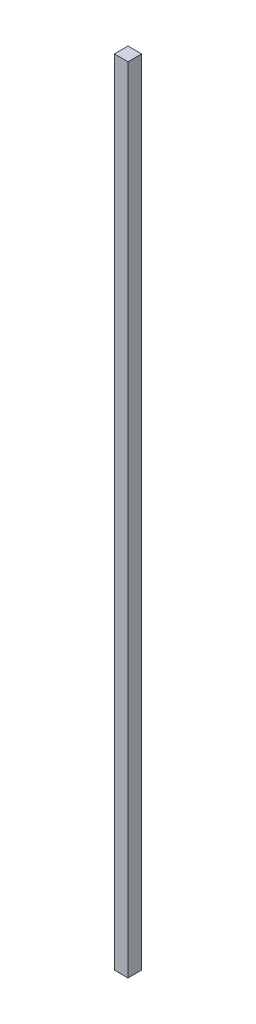
ISO-10303-21;
HEADER;
FILE_DESCRIPTION(('STEP AP214'),'2;1');
FILE_NAME('part.step','',(''),(''),'','','');
FILE_SCHEMA(('AUTOMOTIVE_DESIGN { 1 0 10303 214 1 1 1 1 }'));
ENDSEC;
DATA;
#1=APPLICATION_CONTEXT('core data for automotive mechanical design processes');
#2=APPLICATION_PROTOCOL_DEFINITION('international standard','automotive_design',2000,#1);
#3=PRODUCT_CONTEXT('',#1,'mechanical');
#4=PRODUCT('Part','Part','',(#3));
#5=PRODUCT_RELATED_PRODUCT_CATEGORY('part','',(#4));
#6=PRODUCT_DEFINITION_FORMATION('','',#4);
#7=PRODUCT_DEFINITION_CONTEXT('part definition',#1,'design');
#8=PRODUCT_DEFINITION('design','',#6,#7);
#9=PRODUCT_DEFINITION_SHAPE('','',#8);
#10=(LENGTH_UNIT() NAMED_UNIT(*) SI_UNIT(.MILLI.,.METRE.));
#11=(NAMED_UNIT(*) PLANE_ANGLE_UNIT() SI_UNIT($,.RADIAN.));
#12=(NAMED_UNIT(*) SI_UNIT($,.STERADIAN.) SOLID_ANGLE_UNIT());
#13=UNCERTAINTY_MEASURE_WITH_UNIT(LENGTH_MEASURE(1.E-05),#10,'distance_accuracy_value','');
#14=(GEOMETRIC_REPRESENTATION_CONTEXT(3) GLOBAL_UNCERTAINTY_ASSIGNED_CONTEXT((#13)) GLOBAL_UNIT_ASSIGNED_CONTEXT((#10,
#11,#12)) REPRESENTATION_CONTEXT('',''));
#15=CARTESIAN_POINT('',(0.,0.,0.));
#16=DIRECTION('',(0.,0.,1.));
#17=DIRECTION('',(1.,0.,0.));
#18=AXIS2_PLACEMENT_3D('',#15,#16,#17);
#19=CARTESIAN_POINT('',(-50.,2900.,-29.0760869565217));
#20=DIRECTION('',(1.,0.,0.));
#21=DIRECTION('',(0.,0.,-1.));
#22=AXIS2_PLACEMENT_3D('',#19,#20,#21);
#23=PLANE('',#22);
#24=DIRECTION('',(0.,0.,1.));
#25=VECTOR('',#24,1.);
#26=CARTESIAN_POINT('',(-50.,0.,-29.0760869565217));
#27=LINE('',#26,#25);
#28=CARTESIAN_POINT('',(-50.,0.,-29.0760869565217));
#29=VERTEX_POINT('',#28);
#30=CARTESIAN_POINT('',(-50.,0.,20.9239130434783));
#31=VERTEX_POINT('',#30);
#32=EDGE_CURVE('E107',#29,#31,#27,.T.);
#33=ORIENTED_EDGE('',*,*,#32,.T.);
#34=DIRECTION('',(0.,-1.,0.));
#35=VECTOR('',#34,1.);
#36=CARTESIAN_POINT('',(-50.,2900.,20.9239130434783));
#37=LINE('',#36,#35);
#38=CARTESIAN_POINT('',(-50.,2900.,20.9239130434783));
#39=VERTEX_POINT('',#38);
#40=EDGE_CURVE('E11',#39,#31,#37,.T.);
#41=ORIENTED_EDGE('',*,*,#40,.F.);
#42=DIRECTION('',(0.,0.,1.));
#43=VECTOR('',#42,1.);
#44=CARTESIAN_POINT('',(-50.,2900.,-29.0760869565217));
#45=LINE('',#44,#43);
#46=CARTESIAN_POINT('',(-50.,2900.,-29.0760869565217));
#47=VERTEX_POINT('',#46);
#48=EDGE_CURVE('E89',#47,#39,#45,.T.);
#49=ORIENTED_EDGE('',*,*,#48,.F.);
#50=DIRECTION('',(0.,-1.,0.));
#51=VECTOR('',#50,1.);
#52=CARTESIAN_POINT('',(-50.,2900.,-29.0760869565217));
#53=LINE('',#52,#51);
#54=EDGE_CURVE('E56',#47,#29,#53,.T.);
#55=ORIENTED_EDGE('',*,*,#54,.T.);
#56=EDGE_LOOP('',(#33,#41,#49,#55));
#57=FACE_BOUND('',#56,.T.);
#58=ADVANCED_FACE('F39',(#57),#23,.F.);
#59=CARTESIAN_POINT('',(-50.,2900.,20.9239130434783));
#60=DIRECTION('',(0.,0.,-1.));
#61=DIRECTION('',(-1.,0.,0.));
#62=AXIS2_PLACEMENT_3D('',#59,#60,#61);
#63=PLANE('',#62);
#64=DIRECTION('',(1.,0.,0.));
#65=VECTOR('',#64,1.);
#66=CARTESIAN_POINT('',(-50.,0.,20.9239130434783));
#67=LINE('',#66,#65);
#68=CARTESIAN_POINT('',(0.,0.,20.9239130434783));
#69=VERTEX_POINT('',#68);
#70=EDGE_CURVE('E95',#31,#69,#67,.T.);
#71=ORIENTED_EDGE('',*,*,#70,.T.);
#72=DIRECTION('',(0.,-1.,0.));
#73=VECTOR('',#72,1.);
#74=CARTESIAN_POINT('',(0.,2900.,20.9239130434783));
#75=LINE('',#74,#73);
#76=CARTESIAN_POINT('',(0.,2900.,20.9239130434783));
#77=VERTEX_POINT('',#76);
#78=EDGE_CURVE('E48',#77,#69,#75,.T.);
#79=ORIENTED_EDGE('',*,*,#78,.F.);
#80=DIRECTION('',(1.,0.,0.));
#81=VECTOR('',#80,1.);
#82=CARTESIAN_POINT('',(-50.,2900.,20.9239130434783));
#83=LINE('',#82,#81);
#84=EDGE_CURVE('E81',#39,#77,#83,.T.);
#85=ORIENTED_EDGE('',*,*,#84,.F.);
#86=ORIENTED_EDGE('',*,*,#40,.T.);
#87=EDGE_LOOP('',(#71,#79,#85,#86));
#88=FACE_BOUND('',#87,.T.);
#89=ADVANCED_FACE('F94',(#88),#63,.F.);
#90=CARTESIAN_POINT('',(0.,2900.,-29.0760869565217));
#91=DIRECTION('',(1.,0.,0.));
#92=DIRECTION('',(0.,0.,-1.));
#93=AXIS2_PLACEMENT_3D('',#90,#91,#92);
#94=PLANE('',#93);
#95=DIRECTION('',(0.,0.,1.));
#96=VECTOR('',#95,1.);
#97=CARTESIAN_POINT('',(0.,0.,-29.0760869565217));
#98=LINE('',#97,#96);
#99=CARTESIAN_POINT('',(0.,0.,-29.0760869565217));
#100=VERTEX_POINT('',#99);
#101=EDGE_CURVE('E112',#100,#69,#98,.T.);
#102=ORIENTED_EDGE('',*,*,#101,.F.);
#103=DIRECTION('',(0.,-1.,0.));
#104=VECTOR('',#103,1.);
#105=CARTESIAN_POINT('',(0.,2900.,-29.0760869565217));
#106=LINE('',#105,#104);
#107=CARTESIAN_POINT('',(0.,2900.,-29.0760869565217));
#108=VERTEX_POINT('',#107);
#109=EDGE_CURVE('E70',#108,#100,#106,.T.);
#110=ORIENTED_EDGE('',*,*,#109,.F.);
#111=DIRECTION('',(0.,0.,1.));
#112=VECTOR('',#111,1.);
#113=CARTESIAN_POINT('',(0.,2900.,-29.0760869565217));
#114=LINE('',#113,#112);
#115=EDGE_CURVE('E88',#108,#77,#114,.T.);
#116=ORIENTED_EDGE('',*,*,#115,.T.);
#117=ORIENTED_EDGE('',*,*,#78,.T.);
#118=EDGE_LOOP('',(#102,#110,#116,#117));
#119=FACE_BOUND('',#118,.T.);
#120=ADVANCED_FACE('F99',(#119),#94,.T.);
#121=CARTESIAN_POINT('',(-50.,2900.,-29.0760869565217));
#122=DIRECTION('',(0.,0.,-1.));
#123=DIRECTION('',(-1.,0.,0.));
#124=AXIS2_PLACEMENT_3D('',#121,#122,#123);
#125=PLANE('',#124);
#126=DIRECTION('',(1.,0.,0.));
#127=VECTOR('',#126,1.);
#128=CARTESIAN_POINT('',(-50.,0.,-29.0760869565217));
#129=LINE('',#128,#127);
#130=EDGE_CURVE('E115',#29,#100,#129,.T.);
#131=ORIENTED_EDGE('',*,*,#130,.F.);
#132=ORIENTED_EDGE('',*,*,#54,.F.);
#133=DIRECTION('',(1.,0.,0.));
#134=VECTOR('',#133,1.);
#135=CARTESIAN_POINT('',(-50.,2900.,-29.0760869565217));
#136=LINE('',#135,#134);
#137=EDGE_CURVE('E101',#47,#108,#136,.T.);
#138=ORIENTED_EDGE('',*,*,#137,.T.);
#139=ORIENTED_EDGE('',*,*,#109,.T.);
#140=EDGE_LOOP('',(#131,#132,#138,#139));
#141=FACE_BOUND('',#140,.T.);
#142=ADVANCED_FACE('F125',(#141),#125,.T.);
#143=CARTESIAN_POINT('',(0.,2900.,0.));
#144=DIRECTION('',(0.,1.,0.));
#145=DIRECTION('',(0.,0.,1.));
#146=AXIS2_PLACEMENT_3D('',#143,#144,#145);
#147=PLANE('',#146);
#148=ORIENTED_EDGE('',*,*,#48,.T.);
#149=ORIENTED_EDGE('',*,*,#84,.T.);
#150=ORIENTED_EDGE('',*,*,#115,.F.);
#151=ORIENTED_EDGE('',*,*,#137,.F.);
#152=EDGE_LOOP('',(#148,#149,#150,#151));
#153=FACE_BOUND('',#152,.T.);
#154=ADVANCED_FACE('F85',(#153),#147,.T.);
#155=CARTESIAN_POINT('',(0.,0.,0.));
#156=DIRECTION('',(0.,1.,0.));
#157=DIRECTION('',(0.,0.,1.));
#158=AXIS2_PLACEMENT_3D('',#155,#156,#157);
#159=PLANE('',#158);
#160=ORIENTED_EDGE('',*,*,#32,.F.);
#161=ORIENTED_EDGE('',*,*,#130,.T.);
#162=ORIENTED_EDGE('',*,*,#101,.T.);
#163=ORIENTED_EDGE('',*,*,#70,.F.);
#164=EDGE_LOOP('',(#160,#161,#162,#163));
#165=FACE_BOUND('',#164,.T.);
#166=ADVANCED_FACE('F124',(#165),#159,.F.);
#167=CLOSED_SHELL('',(#58,#89,#120,#142,#154,#166));
#168=MANIFOLD_SOLID_BREP('B2',#167);
#169=ADVANCED_BREP_SHAPE_REPRESENTATION('',(#18,#168),#14);
#170=SHAPE_DEFINITION_REPRESENTATION(#9,#169);
ENDSEC;
END-ISO-10303-21;
